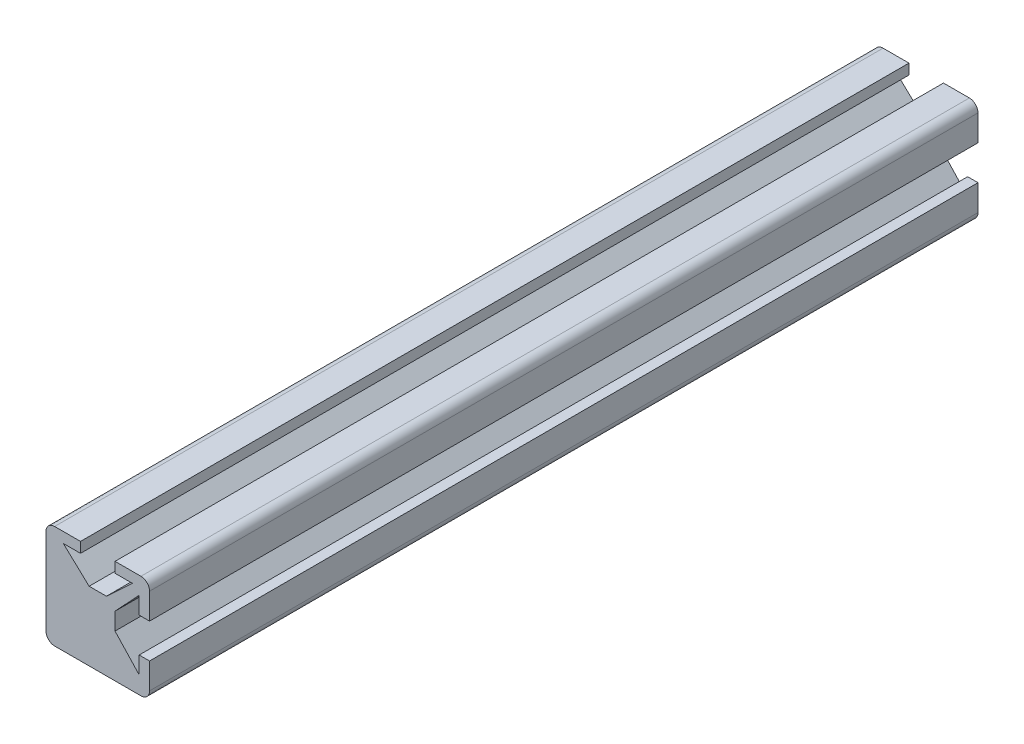
ISO-10303-21;
HEADER;
FILE_DESCRIPTION(('STEP AP214'),'2;1');
FILE_NAME('part.step','',(''),(''),'','','');
FILE_SCHEMA(('AUTOMOTIVE_DESIGN { 1 0 10303 214 1 1 1 1 }'));
ENDSEC;
DATA;
#1=APPLICATION_CONTEXT('core data for automotive mechanical design processes');
#2=APPLICATION_PROTOCOL_DEFINITION('international standard','automotive_design',2000,#1);
#3=PRODUCT_CONTEXT('',#1,'mechanical');
#4=PRODUCT('Part','Part','',(#3));
#5=PRODUCT_RELATED_PRODUCT_CATEGORY('part','',(#4));
#6=PRODUCT_DEFINITION_FORMATION('','',#4);
#7=PRODUCT_DEFINITION_CONTEXT('part definition',#1,'design');
#8=PRODUCT_DEFINITION('design','',#6,#7);
#9=PRODUCT_DEFINITION_SHAPE('','',#8);
#10=(LENGTH_UNIT() NAMED_UNIT(*) SI_UNIT(.MILLI.,.METRE.));
#11=(NAMED_UNIT(*) PLANE_ANGLE_UNIT() SI_UNIT($,.RADIAN.));
#12=(NAMED_UNIT(*) SI_UNIT($,.STERADIAN.) SOLID_ANGLE_UNIT());
#13=UNCERTAINTY_MEASURE_WITH_UNIT(LENGTH_MEASURE(1.E-05),#10,'distance_accuracy_value','');
#14=(GEOMETRIC_REPRESENTATION_CONTEXT(3) GLOBAL_UNCERTAINTY_ASSIGNED_CONTEXT((#13)) GLOBAL_UNIT_ASSIGNED_CONTEXT((#10,
#11,#12)) REPRESENTATION_CONTEXT('',''));
#15=CARTESIAN_POINT('',(0.,0.,0.));
#16=DIRECTION('',(0.,0.,1.));
#17=DIRECTION('',(1.,0.,0.));
#18=AXIS2_PLACEMENT_3D('',#15,#16,#17);
#19=CARTESIAN_POINT('',(-5.,6.,48.));
#20=DIRECTION('',(0.,-1.,0.));
#21=DIRECTION('',(0.,0.,-1.));
#22=AXIS2_PLACEMENT_3D('',#19,#20,#21);
#23=PLANE('',#22);
#24=DIRECTION('',(-1.,0.,0.));
#25=VECTOR('',#24,1.);
#26=CARTESIAN_POINT('',(-5.,6.,-48.));
#27=LINE('',#26,#25);
#28=CARTESIAN_POINT('',(5.,6.,-48.));
#29=VERTEX_POINT('',#28);
#30=CARTESIAN_POINT('',(1.99999999999998,6.00000000000001,-48.));
#31=VERTEX_POINT('',#30);
#32=EDGE_CURVE('E218',#29,#31,#27,.T.);
#33=ORIENTED_EDGE('',*,*,#32,.T.);
#34=DIRECTION('',(0.,0.,1.));
#35=VECTOR('',#34,1.);
#36=CARTESIAN_POINT('',(1.99999999999998,6.00000000000001,-48.));
#37=LINE('',#36,#35);
#38=CARTESIAN_POINT('',(1.99999999999998,6.00000000000001,48.));
#39=VERTEX_POINT('',#38);
#40=EDGE_CURVE('E386',#31,#39,#37,.T.);
#41=ORIENTED_EDGE('',*,*,#40,.T.);
#42=DIRECTION('',(-1.,0.,0.));
#43=VECTOR('',#42,1.);
#44=CARTESIAN_POINT('',(-5.,6.,48.));
#45=LINE('',#44,#43);
#46=CARTESIAN_POINT('',(5.,6.,48.));
#47=VERTEX_POINT('',#46);
#48=EDGE_CURVE('E283',#47,#39,#45,.T.);
#49=ORIENTED_EDGE('',*,*,#48,.F.);
#50=DIRECTION('',(0.,0.,-1.));
#51=VECTOR('',#50,1.);
#52=CARTESIAN_POINT('',(5.,6.,48.));
#53=LINE('',#52,#51);
#54=EDGE_CURVE('E239',#47,#29,#53,.T.);
#55=ORIENTED_EDGE('',*,*,#54,.T.);
#56=EDGE_LOOP('',(#33,#41,#49,#55));
#57=FACE_BOUND('',#56,.T.);
#58=ADVANCED_FACE('F33',(#57),#23,.F.);
#59=CARTESIAN_POINT('',(6.,5.,48.));
#60=DIRECTION('',(-1.,0.,0.));
#61=DIRECTION('',(0.,0.,1.));
#62=AXIS2_PLACEMENT_3D('',#59,#60,#61);
#63=PLANE('',#62);
#64=DIRECTION('',(0.,1.,0.));
#65=VECTOR('',#64,1.);
#66=CARTESIAN_POINT('',(6.,5.,-48.));
#67=LINE('',#66,#65);
#68=CARTESIAN_POINT('',(6.,-5.,-48.));
#69=VERTEX_POINT('',#68);
#70=CARTESIAN_POINT('',(6.,-2.,-48.));
#71=VERTEX_POINT('',#70);
#72=EDGE_CURVE('E222',#69,#71,#67,.T.);
#73=ORIENTED_EDGE('',*,*,#72,.T.);
#74=DIRECTION('',(0.,0.,1.));
#75=VECTOR('',#74,1.);
#76=CARTESIAN_POINT('',(6.,-2.,-48.));
#77=LINE('',#76,#75);
#78=CARTESIAN_POINT('',(6.,-2.,48.));
#79=VERTEX_POINT('',#78);
#80=EDGE_CURVE('E271',#71,#79,#77,.T.);
#81=ORIENTED_EDGE('',*,*,#80,.T.);
#82=DIRECTION('',(0.,1.,0.));
#83=VECTOR('',#82,1.);
#84=CARTESIAN_POINT('',(6.,5.,48.));
#85=LINE('',#84,#83);
#86=CARTESIAN_POINT('',(6.,-5.,48.));
#87=VERTEX_POINT('',#86);
#88=EDGE_CURVE('E273',#87,#79,#85,.T.);
#89=ORIENTED_EDGE('',*,*,#88,.F.);
#90=DIRECTION('',(0.,0.,-1.));
#91=VECTOR('',#90,1.);
#92=CARTESIAN_POINT('',(6.,-5.,48.));
#93=LINE('',#92,#91);
#94=EDGE_CURVE('E245',#87,#69,#93,.T.);
#95=ORIENTED_EDGE('',*,*,#94,.T.);
#96=EDGE_LOOP('',(#73,#81,#89,#95));
#97=FACE_BOUND('',#96,.T.);
#98=ADVANCED_FACE('F269',(#97),#63,.F.);
#99=CARTESIAN_POINT('',(-5.,-5.,48.));
#100=DIRECTION('',(0.,0.,-1.));
#101=DIRECTION('',(-1.,0.,0.));
#102=AXIS2_PLACEMENT_3D('',#99,#100,#101);
#103=CYLINDRICAL_SURFACE('',#102,1.);
#104=CARTESIAN_POINT('',(-5.,-5.,-48.));
#105=DIRECTION('',(0.,0.,1.));
#106=DIRECTION('',(-1.,0.,0.));
#107=AXIS2_PLACEMENT_3D('',#104,#105,#106);
#108=CIRCLE('',#107,1.);
#109=CARTESIAN_POINT('',(-6.,-5.,-48.));
#110=VERTEX_POINT('',#109);
#111=CARTESIAN_POINT('',(-5.,-6.,-48.));
#112=VERTEX_POINT('',#111);
#113=EDGE_CURVE('E264',#110,#112,#108,.T.);
#114=ORIENTED_EDGE('',*,*,#113,.T.);
#115=DIRECTION('',(0.,0.,-1.));
#116=VECTOR('',#115,1.);
#117=CARTESIAN_POINT('',(-5.,-6.,48.));
#118=LINE('',#117,#116);
#119=CARTESIAN_POINT('',(-5.,-6.,48.));
#120=VERTEX_POINT('',#119);
#121=EDGE_CURVE('E11',#120,#112,#118,.T.);
#122=ORIENTED_EDGE('',*,*,#121,.F.);
#123=CARTESIAN_POINT('',(-5.,-5.,48.));
#124=DIRECTION('',(0.,0.,1.));
#125=DIRECTION('',(-1.,0.,0.));
#126=AXIS2_PLACEMENT_3D('',#123,#124,#125);
#127=CIRCLE('',#126,1.);
#128=CARTESIAN_POINT('',(-6.,-5.,48.));
#129=VERTEX_POINT('',#128);
#130=EDGE_CURVE('E229',#129,#120,#127,.T.);
#131=ORIENTED_EDGE('',*,*,#130,.F.);
#132=DIRECTION('',(0.,0.,-1.));
#133=VECTOR('',#132,1.);
#134=CARTESIAN_POINT('',(-6.,-5.,48.));
#135=LINE('',#134,#133);
#136=EDGE_CURVE('E230',#129,#110,#135,.T.);
#137=ORIENTED_EDGE('',*,*,#136,.T.);
#138=EDGE_LOOP('',(#114,#122,#131,#137));
#139=FACE_BOUND('',#138,.T.);
#140=ADVANCED_FACE('F35',(#139),#103,.T.);
#141=CARTESIAN_POINT('',(-5.,-6.,48.));
#142=DIRECTION('',(0.,1.,0.));
#143=DIRECTION('',(-1.,0.,0.));
#144=AXIS2_PLACEMENT_3D('',#141,#142,#143);
#145=PLANE('',#144);
#146=DIRECTION('',(1.,0.,0.));
#147=VECTOR('',#146,1.);
#148=CARTESIAN_POINT('',(-5.,-6.,-48.));
#149=LINE('',#148,#147);
#150=CARTESIAN_POINT('',(5.,-6.,-48.));
#151=VERTEX_POINT('',#150);
#152=EDGE_CURVE('E259',#112,#151,#149,.T.);
#153=ORIENTED_EDGE('',*,*,#152,.T.);
#154=DIRECTION('',(0.,0.,-1.));
#155=VECTOR('',#154,1.);
#156=CARTESIAN_POINT('',(5.,-6.,48.));
#157=LINE('',#156,#155);
#158=CARTESIAN_POINT('',(5.,-6.,48.));
#159=VERTEX_POINT('',#158);
#160=EDGE_CURVE('E41',#159,#151,#157,.T.);
#161=ORIENTED_EDGE('',*,*,#160,.F.);
#162=DIRECTION('',(1.,0.,0.));
#163=VECTOR('',#162,1.);
#164=CARTESIAN_POINT('',(-5.,-6.,48.));
#165=LINE('',#164,#163);
#166=EDGE_CURVE('E312',#120,#159,#165,.T.);
#167=ORIENTED_EDGE('',*,*,#166,.F.);
#168=ORIENTED_EDGE('',*,*,#121,.T.);
#169=EDGE_LOOP('',(#153,#161,#167,#168));
#170=FACE_BOUND('',#169,.T.);
#171=ADVANCED_FACE('F353',(#170),#145,.F.);
#172=CARTESIAN_POINT('',(5.,-5.,48.));
#173=DIRECTION('',(0.,0.,-1.));
#174=DIRECTION('',(-1.,0.,0.));
#175=AXIS2_PLACEMENT_3D('',#172,#173,#174);
#176=CYLINDRICAL_SURFACE('',#175,1.);
#177=CARTESIAN_POINT('',(5.,-5.,-48.));
#178=DIRECTION('',(0.,0.,1.));
#179=DIRECTION('',(-1.,0.,0.));
#180=AXIS2_PLACEMENT_3D('',#177,#178,#179);
#181=CIRCLE('',#180,1.);
#182=EDGE_CURVE('E254',#151,#69,#181,.T.);
#183=ORIENTED_EDGE('',*,*,#182,.T.);
#184=ORIENTED_EDGE('',*,*,#94,.F.);
#185=CARTESIAN_POINT('',(5.,-5.,48.));
#186=DIRECTION('',(0.,0.,1.));
#187=DIRECTION('',(-1.,0.,0.));
#188=AXIS2_PLACEMENT_3D('',#185,#186,#187);
#189=CIRCLE('',#188,1.);
#190=EDGE_CURVE('E255',#159,#87,#189,.T.);
#191=ORIENTED_EDGE('',*,*,#190,.F.);
#192=ORIENTED_EDGE('',*,*,#160,.T.);
#193=EDGE_LOOP('',(#183,#184,#191,#192));
#194=FACE_BOUND('',#193,.T.);
#195=ADVANCED_FACE('F252',(#194),#176,.T.);
#196=CARTESIAN_POINT('',(6.,2.,48.));
#197=VERTEX_POINT('',#196);
#198=CARTESIAN_POINT('',(6.,5.,48.));
#199=VERTEX_POINT('',#198);
#200=EDGE_CURVE('E277',#197,#199,#85,.T.);
#201=ORIENTED_EDGE('',*,*,#200,.F.);
#202=DIRECTION('',(0.,0.,1.));
#203=VECTOR('',#202,1.);
#204=CARTESIAN_POINT('',(6.,2.,-48.));
#205=LINE('',#204,#203);
#206=CARTESIAN_POINT('',(6.,2.,-48.));
#207=VERTEX_POINT('',#206);
#208=EDGE_CURVE('E308',#207,#197,#205,.T.);
#209=ORIENTED_EDGE('',*,*,#208,.F.);
#210=CARTESIAN_POINT('',(6.,5.,-48.));
#211=VERTEX_POINT('',#210);
#212=EDGE_CURVE('E262',#207,#211,#67,.T.);
#213=ORIENTED_EDGE('',*,*,#212,.T.);
#214=DIRECTION('',(0.,0.,-1.));
#215=VECTOR('',#214,1.);
#216=CARTESIAN_POINT('',(6.,5.,48.));
#217=LINE('',#216,#215);
#218=EDGE_CURVE('E242',#199,#211,#217,.T.);
#219=ORIENTED_EDGE('',*,*,#218,.F.);
#220=EDGE_LOOP('',(#201,#209,#213,#219));
#221=FACE_BOUND('',#220,.T.);
#222=ADVANCED_FACE('F336',(#221),#63,.F.);
#223=CARTESIAN_POINT('',(5.,5.,48.));
#224=DIRECTION('',(0.,0.,-1.));
#225=DIRECTION('',(-1.,0.,0.));
#226=AXIS2_PLACEMENT_3D('',#223,#224,#225);
#227=CYLINDRICAL_SURFACE('',#226,1.);
#228=CARTESIAN_POINT('',(5.,5.,-48.));
#229=DIRECTION('',(0.,0.,1.));
#230=DIRECTION('',(-1.,0.,0.));
#231=AXIS2_PLACEMENT_3D('',#228,#229,#230);
#232=CIRCLE('',#231,1.);
#233=EDGE_CURVE('E219',#211,#29,#232,.T.);
#234=ORIENTED_EDGE('',*,*,#233,.T.);
#235=ORIENTED_EDGE('',*,*,#54,.F.);
#236=CARTESIAN_POINT('',(5.,5.,48.));
#237=DIRECTION('',(0.,0.,1.));
#238=DIRECTION('',(-1.,0.,0.));
#239=AXIS2_PLACEMENT_3D('',#236,#237,#238);
#240=CIRCLE('',#239,1.);
#241=EDGE_CURVE('E276',#199,#47,#240,.T.);
#242=ORIENTED_EDGE('',*,*,#241,.F.);
#243=ORIENTED_EDGE('',*,*,#218,.T.);
#244=EDGE_LOOP('',(#234,#235,#242,#243));
#245=FACE_BOUND('',#244,.T.);
#246=ADVANCED_FACE('F340',(#245),#227,.T.);
#247=CARTESIAN_POINT('',(-2.00000000000002,6.,48.));
#248=VERTEX_POINT('',#247);
#249=CARTESIAN_POINT('',(-5.,6.,48.));
#250=VERTEX_POINT('',#249);
#251=EDGE_CURVE('E210',#248,#250,#45,.T.);
#252=ORIENTED_EDGE('',*,*,#251,.F.);
#253=DIRECTION('',(0.,0.,1.));
#254=VECTOR('',#253,1.);
#255=CARTESIAN_POINT('',(-2.00000000000002,6.,-48.));
#256=LINE('',#255,#254);
#257=CARTESIAN_POINT('',(-2.00000000000002,6.,-48.));
#258=VERTEX_POINT('',#257);
#259=EDGE_CURVE('E197',#258,#248,#256,.T.);
#260=ORIENTED_EDGE('',*,*,#259,.F.);
#261=CARTESIAN_POINT('',(-5.,6.,-48.));
#262=VERTEX_POINT('',#261);
#263=EDGE_CURVE('E208',#258,#262,#27,.T.);
#264=ORIENTED_EDGE('',*,*,#263,.T.);
#265=DIRECTION('',(0.,0.,-1.));
#266=VECTOR('',#265,1.);
#267=CARTESIAN_POINT('',(-5.,6.,48.));
#268=LINE('',#267,#266);
#269=EDGE_CURVE('E237',#250,#262,#268,.T.);
#270=ORIENTED_EDGE('',*,*,#269,.F.);
#271=EDGE_LOOP('',(#252,#260,#264,#270));
#272=FACE_BOUND('',#271,.T.);
#273=ADVANCED_FACE('F206',(#272),#23,.F.);
#274=CARTESIAN_POINT('',(-5.,5.,48.));
#275=DIRECTION('',(0.,0.,-1.));
#276=DIRECTION('',(-1.,0.,0.));
#277=AXIS2_PLACEMENT_3D('',#274,#275,#276);
#278=CYLINDRICAL_SURFACE('',#277,1.);
#279=CARTESIAN_POINT('',(-5.,5.,-48.));
#280=DIRECTION('',(0.,0.,1.));
#281=DIRECTION('',(1.,0.,0.));
#282=AXIS2_PLACEMENT_3D('',#279,#280,#281);
#283=CIRCLE('',#282,1.);
#284=CARTESIAN_POINT('',(-6.,5.,-48.));
#285=VERTEX_POINT('',#284);
#286=EDGE_CURVE('E217',#262,#285,#283,.T.);
#287=ORIENTED_EDGE('',*,*,#286,.T.);
#288=DIRECTION('',(0.,0.,-1.));
#289=VECTOR('',#288,1.);
#290=CARTESIAN_POINT('',(-6.,5.,48.));
#291=LINE('',#290,#289);
#292=CARTESIAN_POINT('',(-6.,5.,48.));
#293=VERTEX_POINT('',#292);
#294=EDGE_CURVE('E233',#293,#285,#291,.T.);
#295=ORIENTED_EDGE('',*,*,#294,.F.);
#296=CARTESIAN_POINT('',(-5.,5.,48.));
#297=DIRECTION('',(0.,0.,1.));
#298=DIRECTION('',(1.,0.,0.));
#299=AXIS2_PLACEMENT_3D('',#296,#297,#298);
#300=CIRCLE('',#299,1.);
#301=EDGE_CURVE('E286',#250,#293,#300,.T.);
#302=ORIENTED_EDGE('',*,*,#301,.F.);
#303=ORIENTED_EDGE('',*,*,#269,.T.);
#304=EDGE_LOOP('',(#287,#295,#302,#303));
#305=FACE_BOUND('',#304,.T.);
#306=ADVANCED_FACE('F325',(#305),#278,.T.);
#307=CARTESIAN_POINT('',(-6.,5.,48.));
#308=DIRECTION('',(1.,0.,0.));
#309=DIRECTION('',(0.,1.,0.));
#310=AXIS2_PLACEMENT_3D('',#307,#308,#309);
#311=PLANE('',#310);
#312=DIRECTION('',(0.,-1.,0.));
#313=VECTOR('',#312,1.);
#314=CARTESIAN_POINT('',(-6.,5.,-48.));
#315=LINE('',#314,#313);
#316=EDGE_CURVE('E227',#285,#110,#315,.T.);
#317=ORIENTED_EDGE('',*,*,#316,.T.);
#318=ORIENTED_EDGE('',*,*,#136,.F.);
#319=DIRECTION('',(0.,-1.,0.));
#320=VECTOR('',#319,1.);
#321=CARTESIAN_POINT('',(-6.,5.,48.));
#322=LINE('',#321,#320);
#323=EDGE_CURVE('E234',#293,#129,#322,.T.);
#324=ORIENTED_EDGE('',*,*,#323,.F.);
#325=ORIENTED_EDGE('',*,*,#294,.T.);
#326=EDGE_LOOP('',(#317,#318,#324,#325));
#327=FACE_BOUND('',#326,.T.);
#328=ADVANCED_FACE('F317',(#327),#311,.F.);
#329=CARTESIAN_POINT('',(-5.,-5.,48.));
#330=DIRECTION('',(0.,0.,-1.));
#331=DIRECTION('',(-1.,0.,0.));
#332=AXIS2_PLACEMENT_3D('',#329,#330,#331);
#333=PLANE('',#332);
#334=ORIENTED_EDGE('',*,*,#48,.T.);
#335=DIRECTION('',(0.,1.,0.));
#336=VECTOR('',#335,1.);
#337=CARTESIAN_POINT('',(1.99999999999998,4.80000000000001,48.));
#338=LINE('',#337,#336);
#339=CARTESIAN_POINT('',(1.99999999999998,4.80000000000001,48.));
#340=VERTEX_POINT('',#339);
#341=EDGE_CURVE('E202',#340,#39,#338,.T.);
#342=ORIENTED_EDGE('',*,*,#341,.F.);
#343=DIRECTION('',(-1.,0.,0.));
#344=VECTOR('',#343,1.);
#345=CARTESIAN_POINT('',(3.99999999999998,4.80000000000002,48.));
#346=LINE('',#345,#344);
#347=CARTESIAN_POINT('',(3.99999999999998,4.80000000000002,48.));
#348=VERTEX_POINT('',#347);
#349=EDGE_CURVE('E382',#348,#340,#346,.T.);
#350=ORIENTED_EDGE('',*,*,#349,.F.);
#351=DIRECTION('',(0.731055268242867,0.682318250360014,0.));
#352=VECTOR('',#351,1.);
#353=CARTESIAN_POINT('',(3.99999999999998,4.80000000000002,48.));
#354=LINE('',#353,#352);
#355=CARTESIAN_POINT('',(0.999999999999993,2.,48.));
#356=VERTEX_POINT('',#355);
#357=EDGE_CURVE('E379',#356,#348,#354,.T.);
#358=ORIENTED_EDGE('',*,*,#357,.F.);
#359=DIRECTION('',(1.,0.,0.));
#360=VECTOR('',#359,1.);
#361=CARTESIAN_POINT('',(-1.00000000000001,2.,48.));
#362=LINE('',#361,#360);
#363=CARTESIAN_POINT('',(-1.00000000000001,2.,48.));
#364=VERTEX_POINT('',#363);
#365=EDGE_CURVE('E376',#364,#356,#362,.T.);
#366=ORIENTED_EDGE('',*,*,#365,.F.);
#367=DIRECTION('',(0.731055268242871,-0.682318250360009,0.));
#368=VECTOR('',#367,1.);
#369=CARTESIAN_POINT('',(-4.00000000000002,4.79999999999999,48.));
#370=LINE('',#369,#368);
#371=CARTESIAN_POINT('',(-4.00000000000002,4.79999999999999,48.));
#372=VERTEX_POINT('',#371);
#373=EDGE_CURVE('E369',#372,#364,#370,.T.);
#374=ORIENTED_EDGE('',*,*,#373,.F.);
#375=DIRECTION('',(-1.,0.,0.));
#376=VECTOR('',#375,1.);
#377=CARTESIAN_POINT('',(-2.00000000000002,4.8,48.));
#378=LINE('',#377,#376);
#379=CARTESIAN_POINT('',(-2.00000000000002,4.8,48.));
#380=VERTEX_POINT('',#379);
#381=EDGE_CURVE('E367',#380,#372,#378,.T.);
#382=ORIENTED_EDGE('',*,*,#381,.F.);
#383=DIRECTION('',(0.,-1.,0.));
#384=VECTOR('',#383,1.);
#385=CARTESIAN_POINT('',(-2.00000000000002,6.,48.));
#386=LINE('',#385,#384);
#387=EDGE_CURVE('E364',#248,#380,#386,.T.);
#388=ORIENTED_EDGE('',*,*,#387,.F.);
#389=ORIENTED_EDGE('',*,*,#251,.T.);
#390=ORIENTED_EDGE('',*,*,#301,.T.);
#391=ORIENTED_EDGE('',*,*,#323,.T.);
#392=ORIENTED_EDGE('',*,*,#130,.T.);
#393=ORIENTED_EDGE('',*,*,#166,.T.);
#394=ORIENTED_EDGE('',*,*,#190,.T.);
#395=ORIENTED_EDGE('',*,*,#88,.T.);
#396=DIRECTION('',(1.,0.,0.));
#397=VECTOR('',#396,1.);
#398=CARTESIAN_POINT('',(4.8,-2.,48.));
#399=LINE('',#398,#397);
#400=CARTESIAN_POINT('',(4.8,-2.,48.));
#401=VERTEX_POINT('',#400);
#402=EDGE_CURVE('E296',#401,#79,#399,.T.);
#403=ORIENTED_EDGE('',*,*,#402,.F.);
#404=DIRECTION('',(0.,1.,0.));
#405=VECTOR('',#404,1.);
#406=CARTESIAN_POINT('',(4.8,-4.,48.));
#407=LINE('',#406,#405);
#408=CARTESIAN_POINT('',(4.8,-4.,48.));
#409=VERTEX_POINT('',#408);
#410=EDGE_CURVE('E431',#409,#401,#407,.T.);
#411=ORIENTED_EDGE('',*,*,#410,.F.);
#412=DIRECTION('',(0.682318250360011,-0.731055268242869,0.));
#413=VECTOR('',#412,1.);
#414=CARTESIAN_POINT('',(4.8,-4.,48.));
#415=LINE('',#414,#413);
#416=CARTESIAN_POINT('',(2.,-1.,48.));
#417=VERTEX_POINT('',#416);
#418=EDGE_CURVE('E429',#417,#409,#415,.T.);
#419=ORIENTED_EDGE('',*,*,#418,.F.);
#420=DIRECTION('',(0.,-1.,0.));
#421=VECTOR('',#420,1.);
#422=CARTESIAN_POINT('',(2.,1.,48.));
#423=LINE('',#422,#421);
#424=CARTESIAN_POINT('',(2.,1.,48.));
#425=VERTEX_POINT('',#424);
#426=EDGE_CURVE('E426',#425,#417,#423,.T.);
#427=ORIENTED_EDGE('',*,*,#426,.F.);
#428=DIRECTION('',(-0.682318250360011,-0.731055268242869,0.));
#429=VECTOR('',#428,1.);
#430=CARTESIAN_POINT('',(4.8,4.,48.));
#431=LINE('',#430,#429);
#432=CARTESIAN_POINT('',(4.8,4.,48.));
#433=VERTEX_POINT('',#432);
#434=EDGE_CURVE('E423',#433,#425,#431,.T.);
#435=ORIENTED_EDGE('',*,*,#434,.F.);
#436=DIRECTION('',(0.,1.,0.));
#437=VECTOR('',#436,1.);
#438=CARTESIAN_POINT('',(4.8,2.,48.));
#439=LINE('',#438,#437);
#440=CARTESIAN_POINT('',(4.8,2.,48.));
#441=VERTEX_POINT('',#440);
#442=EDGE_CURVE('E420',#441,#433,#439,.T.);
#443=ORIENTED_EDGE('',*,*,#442,.F.);
#444=DIRECTION('',(-1.,0.,0.));
#445=VECTOR('',#444,1.);
#446=CARTESIAN_POINT('',(6.,2.,48.));
#447=LINE('',#446,#445);
#448=EDGE_CURVE('E389',#197,#441,#447,.T.);
#449=ORIENTED_EDGE('',*,*,#448,.F.);
#450=ORIENTED_EDGE('',*,*,#200,.T.);
#451=ORIENTED_EDGE('',*,*,#241,.T.);
#452=EDGE_LOOP('',(#334,#342,#350,#358,#366,#374,#382,#388,#389,#390,#391,#392,#393,#394,#395,
#403,#411,#419,#427,#435,#443,#449,#450,#451));
#453=FACE_BOUND('',#452,.T.);
#454=ADVANCED_FACE('F313',(#453),#333,.F.);
#455=CARTESIAN_POINT('',(-5.,-5.,-48.));
#456=DIRECTION('',(0.,0.,-1.));
#457=DIRECTION('',(-1.,0.,0.));
#458=AXIS2_PLACEMENT_3D('',#455,#456,#457);
#459=PLANE('',#458);
#460=DIRECTION('',(0.,1.,0.));
#461=VECTOR('',#460,1.);
#462=CARTESIAN_POINT('',(1.99999999999998,4.80000000000001,-48.));
#463=LINE('',#462,#461);
#464=CARTESIAN_POINT('',(1.99999999999998,4.80000000000001,-48.));
#465=VERTEX_POINT('',#464);
#466=EDGE_CURVE('E211',#465,#31,#463,.T.);
#467=ORIENTED_EDGE('',*,*,#466,.T.);
#468=ORIENTED_EDGE('',*,*,#32,.F.);
#469=ORIENTED_EDGE('',*,*,#233,.F.);
#470=ORIENTED_EDGE('',*,*,#212,.F.);
#471=DIRECTION('',(-1.,0.,0.));
#472=VECTOR('',#471,1.);
#473=CARTESIAN_POINT('',(6.,2.,-48.));
#474=LINE('',#473,#472);
#475=CARTESIAN_POINT('',(4.8,2.,-48.));
#476=VERTEX_POINT('',#475);
#477=EDGE_CURVE('E401',#207,#476,#474,.T.);
#478=ORIENTED_EDGE('',*,*,#477,.T.);
#479=DIRECTION('',(0.,1.,0.));
#480=VECTOR('',#479,1.);
#481=CARTESIAN_POINT('',(4.8,2.,-48.));
#482=LINE('',#481,#480);
#483=CARTESIAN_POINT('',(4.8,4.,-48.));
#484=VERTEX_POINT('',#483);
#485=EDGE_CURVE('E56',#476,#484,#482,.T.);
#486=ORIENTED_EDGE('',*,*,#485,.T.);
#487=DIRECTION('',(-0.682318250360011,-0.731055268242869,0.));
#488=VECTOR('',#487,1.);
#489=CARTESIAN_POINT('',(4.8,4.,-48.));
#490=LINE('',#489,#488);
#491=CARTESIAN_POINT('',(2.,1.,-48.));
#492=VERTEX_POINT('',#491);
#493=EDGE_CURVE('E405',#484,#492,#490,.T.);
#494=ORIENTED_EDGE('',*,*,#493,.T.);
#495=DIRECTION('',(0.,-1.,0.));
#496=VECTOR('',#495,1.);
#497=CARTESIAN_POINT('',(2.,1.,-48.));
#498=LINE('',#497,#496);
#499=CARTESIAN_POINT('',(2.,-1.,-48.));
#500=VERTEX_POINT('',#499);
#501=EDGE_CURVE('E408',#492,#500,#498,.T.);
#502=ORIENTED_EDGE('',*,*,#501,.T.);
#503=DIRECTION('',(0.682318250360011,-0.731055268242869,0.));
#504=VECTOR('',#503,1.);
#505=CARTESIAN_POINT('',(4.8,-4.,-48.));
#506=LINE('',#505,#504);
#507=CARTESIAN_POINT('',(4.8,-4.,-48.));
#508=VERTEX_POINT('',#507);
#509=EDGE_CURVE('E411',#500,#508,#506,.T.);
#510=ORIENTED_EDGE('',*,*,#509,.T.);
#511=DIRECTION('',(0.,1.,0.));
#512=VECTOR('',#511,1.);
#513=CARTESIAN_POINT('',(4.8,-4.,-48.));
#514=LINE('',#513,#512);
#515=CARTESIAN_POINT('',(4.8,-2.,-48.));
#516=VERTEX_POINT('',#515);
#517=EDGE_CURVE('E414',#508,#516,#514,.T.);
#518=ORIENTED_EDGE('',*,*,#517,.T.);
#519=DIRECTION('',(1.,0.,0.));
#520=VECTOR('',#519,1.);
#521=CARTESIAN_POINT('',(4.8,-2.,-48.));
#522=LINE('',#521,#520);
#523=EDGE_CURVE('E310',#516,#71,#522,.T.);
#524=ORIENTED_EDGE('',*,*,#523,.T.);
#525=ORIENTED_EDGE('',*,*,#72,.F.);
#526=ORIENTED_EDGE('',*,*,#182,.F.);
#527=ORIENTED_EDGE('',*,*,#152,.F.);
#528=ORIENTED_EDGE('',*,*,#113,.F.);
#529=ORIENTED_EDGE('',*,*,#316,.F.);
#530=ORIENTED_EDGE('',*,*,#286,.F.);
#531=ORIENTED_EDGE('',*,*,#263,.F.);
#532=DIRECTION('',(0.,-1.,0.));
#533=VECTOR('',#532,1.);
#534=CARTESIAN_POINT('',(-2.00000000000002,6.,-48.));
#535=LINE('',#534,#533);
#536=CARTESIAN_POINT('',(-2.00000000000002,4.8,-48.));
#537=VERTEX_POINT('',#536);
#538=EDGE_CURVE('E193',#258,#537,#535,.T.);
#539=ORIENTED_EDGE('',*,*,#538,.T.);
#540=DIRECTION('',(-1.,0.,0.));
#541=VECTOR('',#540,1.);
#542=CARTESIAN_POINT('',(-2.00000000000002,4.8,-48.));
#543=LINE('',#542,#541);
#544=CARTESIAN_POINT('',(-4.00000000000002,4.79999999999999,-48.));
#545=VERTEX_POINT('',#544);
#546=EDGE_CURVE('E48',#537,#545,#543,.T.);
#547=ORIENTED_EDGE('',*,*,#546,.T.);
#548=DIRECTION('',(0.731055268242871,-0.682318250360009,0.));
#549=VECTOR('',#548,1.);
#550=CARTESIAN_POINT('',(-4.00000000000002,4.79999999999999,-48.));
#551=LINE('',#550,#549);
#552=CARTESIAN_POINT('',(-1.00000000000001,2.,-48.));
#553=VERTEX_POINT('',#552);
#554=EDGE_CURVE('E476',#545,#553,#551,.T.);
#555=ORIENTED_EDGE('',*,*,#554,.T.);
#556=DIRECTION('',(1.,0.,0.));
#557=VECTOR('',#556,1.);
#558=CARTESIAN_POINT('',(-1.00000000000001,2.,-48.));
#559=LINE('',#558,#557);
#560=CARTESIAN_POINT('',(0.999999999999993,2.,-48.));
#561=VERTEX_POINT('',#560);
#562=EDGE_CURVE('E471',#553,#561,#559,.T.);
#563=ORIENTED_EDGE('',*,*,#562,.T.);
#564=DIRECTION('',(0.731055268242867,0.682318250360014,0.));
#565=VECTOR('',#564,1.);
#566=CARTESIAN_POINT('',(3.99999999999998,4.80000000000002,-48.));
#567=LINE('',#566,#565);
#568=CARTESIAN_POINT('',(3.99999999999998,4.80000000000002,-48.));
#569=VERTEX_POINT('',#568);
#570=EDGE_CURVE('E470',#561,#569,#567,.T.);
#571=ORIENTED_EDGE('',*,*,#570,.T.);
#572=DIRECTION('',(-1.,0.,0.));
#573=VECTOR('',#572,1.);
#574=CARTESIAN_POINT('',(3.99999999999998,4.80000000000002,-48.));
#575=LINE('',#574,#573);
#576=EDGE_CURVE('E469',#569,#465,#575,.T.);
#577=ORIENTED_EDGE('',*,*,#576,.T.);
#578=EDGE_LOOP('',(#467,#468,#469,#470,#478,#486,#494,#502,#510,#518,#524,#525,#526,#527,#528,
#529,#530,#531,#539,#547,#555,#563,#571,#577));
#579=FACE_BOUND('',#578,.T.);
#580=ADVANCED_FACE('F215',(#579),#459,.T.);
#581=CARTESIAN_POINT('',(4.8,-2.,-48.));
#582=DIRECTION('',(0.,-1.,0.));
#583=DIRECTION('',(0.,0.,-1.));
#584=AXIS2_PLACEMENT_3D('',#581,#582,#583);
#585=PLANE('',#584);
#586=ORIENTED_EDGE('',*,*,#402,.T.);
#587=ORIENTED_EDGE('',*,*,#80,.F.);
#588=ORIENTED_EDGE('',*,*,#523,.F.);
#589=DIRECTION('',(0.,0.,1.));
#590=VECTOR('',#589,1.);
#591=CARTESIAN_POINT('',(4.8,-2.,-48.));
#592=LINE('',#591,#590);
#593=EDGE_CURVE('E291',#516,#401,#592,.T.);
#594=ORIENTED_EDGE('',*,*,#593,.T.);
#595=EDGE_LOOP('',(#586,#587,#588,#594));
#596=FACE_BOUND('',#595,.T.);
#597=ADVANCED_FACE('F323',(#596),#585,.F.);
#598=CARTESIAN_POINT('',(4.8,-4.,-48.));
#599=DIRECTION('',(1.,0.,0.));
#600=DIRECTION('',(0.,0.,-1.));
#601=AXIS2_PLACEMENT_3D('',#598,#599,#600);
#602=PLANE('',#601);
#603=ORIENTED_EDGE('',*,*,#410,.T.);
#604=ORIENTED_EDGE('',*,*,#593,.F.);
#605=ORIENTED_EDGE('',*,*,#517,.F.);
#606=DIRECTION('',(0.,0.,1.));
#607=VECTOR('',#606,1.);
#608=CARTESIAN_POINT('',(4.8,-4.,-48.));
#609=LINE('',#608,#607);
#610=EDGE_CURVE('E293',#508,#409,#609,.T.);
#611=ORIENTED_EDGE('',*,*,#610,.T.);
#612=EDGE_LOOP('',(#603,#604,#605,#611));
#613=FACE_BOUND('',#612,.T.);
#614=ADVANCED_FACE('F513',(#613),#602,.F.);
#615=CARTESIAN_POINT('',(4.8,-4.,-48.));
#616=DIRECTION('',(-0.731055268242869,-0.682318250360011,0.));
#617=DIRECTION('',(0.682318250360011,-0.731055268242869,0.));
#618=AXIS2_PLACEMENT_3D('',#615,#616,#617);
#619=PLANE('',#618);
#620=ORIENTED_EDGE('',*,*,#418,.T.);
#621=ORIENTED_EDGE('',*,*,#610,.F.);
#622=ORIENTED_EDGE('',*,*,#509,.F.);
#623=DIRECTION('',(0.,0.,1.));
#624=VECTOR('',#623,1.);
#625=CARTESIAN_POINT('',(2.,-1.,-48.));
#626=LINE('',#625,#624);
#627=EDGE_CURVE('E300',#500,#417,#626,.T.);
#628=ORIENTED_EDGE('',*,*,#627,.T.);
#629=EDGE_LOOP('',(#620,#621,#622,#628));
#630=FACE_BOUND('',#629,.T.);
#631=ADVANCED_FACE('F441',(#630),#619,.F.);
#632=CARTESIAN_POINT('',(2.,1.,-48.));
#633=DIRECTION('',(-1.,0.,0.));
#634=DIRECTION('',(0.,0.,1.));
#635=AXIS2_PLACEMENT_3D('',#632,#633,#634);
#636=PLANE('',#635);
#637=ORIENTED_EDGE('',*,*,#426,.T.);
#638=ORIENTED_EDGE('',*,*,#627,.F.);
#639=ORIENTED_EDGE('',*,*,#501,.F.);
#640=DIRECTION('',(0.,0.,1.));
#641=VECTOR('',#640,1.);
#642=CARTESIAN_POINT('',(2.,1.,-48.));
#643=LINE('',#642,#641);
#644=EDGE_CURVE('E302',#492,#425,#643,.T.);
#645=ORIENTED_EDGE('',*,*,#644,.T.);
#646=EDGE_LOOP('',(#637,#638,#639,#645));
#647=FACE_BOUND('',#646,.T.);
#648=ADVANCED_FACE('F446',(#647),#636,.F.);
#649=CARTESIAN_POINT('',(4.8,4.,-48.));
#650=DIRECTION('',(-0.731055268242869,0.682318250360011,0.));
#651=DIRECTION('',(-0.682318250360011,-0.731055268242869,0.));
#652=AXIS2_PLACEMENT_3D('',#649,#650,#651);
#653=PLANE('',#652);
#654=ORIENTED_EDGE('',*,*,#434,.T.);
#655=ORIENTED_EDGE('',*,*,#644,.F.);
#656=ORIENTED_EDGE('',*,*,#493,.F.);
#657=DIRECTION('',(0.,0.,1.));
#658=VECTOR('',#657,1.);
#659=CARTESIAN_POINT('',(4.8,4.,-48.));
#660=LINE('',#659,#658);
#661=EDGE_CURVE('E304',#484,#433,#660,.T.);
#662=ORIENTED_EDGE('',*,*,#661,.T.);
#663=EDGE_LOOP('',(#654,#655,#656,#662));
#664=FACE_BOUND('',#663,.T.);
#665=ADVANCED_FACE('F449',(#664),#653,.F.);
#666=CARTESIAN_POINT('',(4.8,2.,-48.));
#667=DIRECTION('',(1.,0.,0.));
#668=DIRECTION('',(0.,0.,-1.));
#669=AXIS2_PLACEMENT_3D('',#666,#667,#668);
#670=PLANE('',#669);
#671=ORIENTED_EDGE('',*,*,#442,.T.);
#672=ORIENTED_EDGE('',*,*,#661,.F.);
#673=ORIENTED_EDGE('',*,*,#485,.F.);
#674=DIRECTION('',(0.,0.,1.));
#675=VECTOR('',#674,1.);
#676=CARTESIAN_POINT('',(4.8,2.,-48.));
#677=LINE('',#676,#675);
#678=EDGE_CURVE('E306',#476,#441,#677,.T.);
#679=ORIENTED_EDGE('',*,*,#678,.T.);
#680=EDGE_LOOP('',(#671,#672,#673,#679));
#681=FACE_BOUND('',#680,.T.);
#682=ADVANCED_FACE('F453',(#681),#670,.F.);
#683=CARTESIAN_POINT('',(6.,2.,-48.));
#684=DIRECTION('',(0.,1.,0.));
#685=DIRECTION('',(0.,0.,1.));
#686=AXIS2_PLACEMENT_3D('',#683,#684,#685);
#687=PLANE('',#686);
#688=ORIENTED_EDGE('',*,*,#448,.T.);
#689=ORIENTED_EDGE('',*,*,#678,.F.);
#690=ORIENTED_EDGE('',*,*,#477,.F.);
#691=ORIENTED_EDGE('',*,*,#208,.T.);
#692=EDGE_LOOP('',(#688,#689,#690,#691));
#693=FACE_BOUND('',#692,.T.);
#694=ADVANCED_FACE('F455',(#693),#687,.F.);
#695=CARTESIAN_POINT('',(1.99999999999998,4.80000000000001,-48.));
#696=DIRECTION('',(1.,0.,0.));
#697=DIRECTION('',(0.,1.,0.));
#698=AXIS2_PLACEMENT_3D('',#695,#696,#697);
#699=PLANE('',#698);
#700=ORIENTED_EDGE('',*,*,#341,.T.);
#701=ORIENTED_EDGE('',*,*,#40,.F.);
#702=ORIENTED_EDGE('',*,*,#466,.F.);
#703=DIRECTION('',(0.,0.,1.));
#704=VECTOR('',#703,1.);
#705=CARTESIAN_POINT('',(1.99999999999998,4.80000000000001,-48.));
#706=LINE('',#705,#704);
#707=EDGE_CURVE('E390',#465,#340,#706,.T.);
#708=ORIENTED_EDGE('',*,*,#707,.T.);
#709=EDGE_LOOP('',(#700,#701,#702,#708));
#710=FACE_BOUND('',#709,.T.);
#711=ADVANCED_FACE('F465',(#710),#699,.F.);
#712=CARTESIAN_POINT('',(3.99999999999998,4.80000000000002,-48.));
#713=DIRECTION('',(0.,1.,0.));
#714=DIRECTION('',(-1.,0.,0.));
#715=AXIS2_PLACEMENT_3D('',#712,#713,#714);
#716=PLANE('',#715);
#717=ORIENTED_EDGE('',*,*,#349,.T.);
#718=ORIENTED_EDGE('',*,*,#707,.F.);
#719=ORIENTED_EDGE('',*,*,#576,.F.);
#720=DIRECTION('',(0.,0.,1.));
#721=VECTOR('',#720,1.);
#722=CARTESIAN_POINT('',(3.99999999999998,4.80000000000002,-48.));
#723=LINE('',#722,#721);
#724=EDGE_CURVE('E392',#569,#348,#723,.T.);
#725=ORIENTED_EDGE('',*,*,#724,.T.);
#726=EDGE_LOOP('',(#717,#718,#719,#725));
#727=FACE_BOUND('',#726,.T.);
#728=ADVANCED_FACE('F492',(#727),#716,.F.);
#729=CARTESIAN_POINT('',(3.99999999999998,4.80000000000002,-48.));
#730=DIRECTION('',(0.682318250360014,-0.731055268242866,0.));
#731=DIRECTION('',(0.731055268242866,0.682318250360014,0.));
#732=AXIS2_PLACEMENT_3D('',#729,#730,#731);
#733=PLANE('',#732);
#734=ORIENTED_EDGE('',*,*,#357,.T.);
#735=ORIENTED_EDGE('',*,*,#724,.F.);
#736=ORIENTED_EDGE('',*,*,#570,.F.);
#737=DIRECTION('',(0.,0.,1.));
#738=VECTOR('',#737,1.);
#739=CARTESIAN_POINT('',(0.999999999999993,2.,-48.));
#740=LINE('',#739,#738);
#741=EDGE_CURVE('E394',#561,#356,#740,.T.);
#742=ORIENTED_EDGE('',*,*,#741,.T.);
#743=EDGE_LOOP('',(#734,#735,#736,#742));
#744=FACE_BOUND('',#743,.T.);
#745=ADVANCED_FACE('F489',(#744),#733,.F.);
#746=CARTESIAN_POINT('',(-1.00000000000001,2.,-48.));
#747=DIRECTION('',(0.,-1.,0.));
#748=DIRECTION('',(1.,0.,0.));
#749=AXIS2_PLACEMENT_3D('',#746,#747,#748);
#750=PLANE('',#749);
#751=ORIENTED_EDGE('',*,*,#365,.T.);
#752=ORIENTED_EDGE('',*,*,#741,.F.);
#753=ORIENTED_EDGE('',*,*,#562,.F.);
#754=DIRECTION('',(0.,0.,1.));
#755=VECTOR('',#754,1.);
#756=CARTESIAN_POINT('',(-1.00000000000001,2.,-48.));
#757=LINE('',#756,#755);
#758=EDGE_CURVE('E396',#553,#364,#757,.T.);
#759=ORIENTED_EDGE('',*,*,#758,.T.);
#760=EDGE_LOOP('',(#751,#752,#753,#759));
#761=FACE_BOUND('',#760,.T.);
#762=ADVANCED_FACE('F485',(#761),#750,.F.);
#763=CARTESIAN_POINT('',(-4.00000000000002,4.79999999999999,-48.));
#764=DIRECTION('',(-0.682318250360009,-0.731055268242871,0.));
#765=DIRECTION('',(0.731055268242871,-0.682318250360009,0.));
#766=AXIS2_PLACEMENT_3D('',#763,#764,#765);
#767=PLANE('',#766);
#768=ORIENTED_EDGE('',*,*,#373,.T.);
#769=ORIENTED_EDGE('',*,*,#758,.F.);
#770=ORIENTED_EDGE('',*,*,#554,.F.);
#771=DIRECTION('',(0.,0.,1.));
#772=VECTOR('',#771,1.);
#773=CARTESIAN_POINT('',(-4.00000000000002,4.79999999999999,-48.));
#774=LINE('',#773,#772);
#775=EDGE_CURVE('E398',#545,#372,#774,.T.);
#776=ORIENTED_EDGE('',*,*,#775,.T.);
#777=EDGE_LOOP('',(#768,#769,#770,#776));
#778=FACE_BOUND('',#777,.T.);
#779=ADVANCED_FACE('F482',(#778),#767,.F.);
#780=CARTESIAN_POINT('',(-2.00000000000002,4.8,-48.));
#781=DIRECTION('',(0.,1.,0.));
#782=DIRECTION('',(-1.,0.,0.));
#783=AXIS2_PLACEMENT_3D('',#780,#781,#782);
#784=PLANE('',#783);
#785=ORIENTED_EDGE('',*,*,#381,.T.);
#786=ORIENTED_EDGE('',*,*,#775,.F.);
#787=ORIENTED_EDGE('',*,*,#546,.F.);
#788=DIRECTION('',(0.,0.,1.));
#789=VECTOR('',#788,1.);
#790=CARTESIAN_POINT('',(-2.00000000000002,4.8,-48.));
#791=LINE('',#790,#789);
#792=EDGE_CURVE('E199',#537,#380,#791,.T.);
#793=ORIENTED_EDGE('',*,*,#792,.T.);
#794=EDGE_LOOP('',(#785,#786,#787,#793));
#795=FACE_BOUND('',#794,.T.);
#796=ADVANCED_FACE('F506',(#795),#784,.F.);
#797=CARTESIAN_POINT('',(-2.00000000000002,6.,-48.));
#798=DIRECTION('',(-1.,0.,0.));
#799=DIRECTION('',(0.,-1.,0.));
#800=AXIS2_PLACEMENT_3D('',#797,#798,#799);
#801=PLANE('',#800);
#802=ORIENTED_EDGE('',*,*,#387,.T.);
#803=ORIENTED_EDGE('',*,*,#792,.F.);
#804=ORIENTED_EDGE('',*,*,#538,.F.);
#805=ORIENTED_EDGE('',*,*,#259,.T.);
#806=EDGE_LOOP('',(#802,#803,#804,#805));
#807=FACE_BOUND('',#806,.T.);
#808=ADVANCED_FACE('F196',(#807),#801,.F.);
#809=CLOSED_SHELL('',(#58,#98,#140,#171,#195,#222,#246,#273,#306,#328,#454,#580,#597,#614,#631,
#648,#665,#682,#694,#711,#728,#745,#762,#779,#796,#808));
#810=MANIFOLD_SOLID_BREP('B2',#809);
#811=ADVANCED_BREP_SHAPE_REPRESENTATION('',(#18,#810),#14);
#812=SHAPE_DEFINITION_REPRESENTATION(#9,#811);
ENDSEC;
END-ISO-10303-21;
